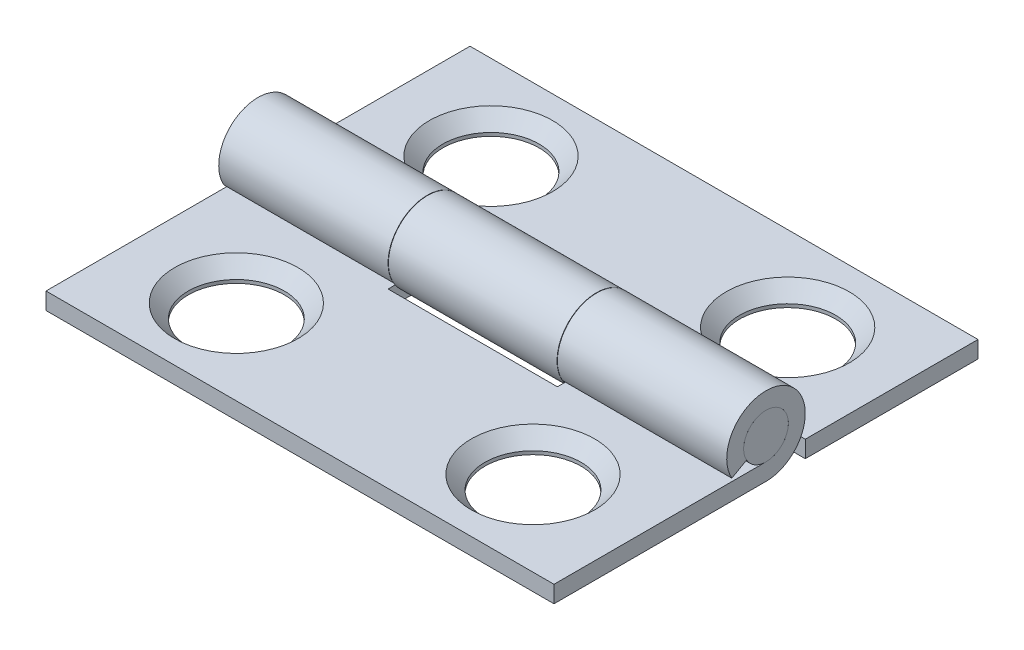
ISO-10303-21;
HEADER;
FILE_DESCRIPTION(('STEP AP214'),'2;1');
FILE_NAME('part.step','',(''),(''),'','','');
FILE_SCHEMA(('AUTOMOTIVE_DESIGN { 1 0 10303 214 1 1 1 1 }'));
ENDSEC;
DATA;
#1=APPLICATION_CONTEXT('core data for automotive mechanical design processes');
#2=APPLICATION_PROTOCOL_DEFINITION('international standard','automotive_design',2000,#1);
#3=PRODUCT_CONTEXT('',#1,'mechanical');
#4=PRODUCT('Part','Part','',(#3));
#5=PRODUCT_RELATED_PRODUCT_CATEGORY('part','',(#4));
#6=PRODUCT_DEFINITION_FORMATION('','',#4);
#7=PRODUCT_DEFINITION_CONTEXT('part definition',#1,'design');
#8=PRODUCT_DEFINITION('design','',#6,#7);
#9=PRODUCT_DEFINITION_SHAPE('','',#8);
#10=(LENGTH_UNIT() NAMED_UNIT(*) SI_UNIT(.MILLI.,.METRE.));
#11=(NAMED_UNIT(*) PLANE_ANGLE_UNIT() SI_UNIT($,.RADIAN.));
#12=(NAMED_UNIT(*) SI_UNIT($,.STERADIAN.) SOLID_ANGLE_UNIT());
#13=UNCERTAINTY_MEASURE_WITH_UNIT(LENGTH_MEASURE(1.E-05),#10,'distance_accuracy_value','');
#14=(GEOMETRIC_REPRESENTATION_CONTEXT(3) GLOBAL_UNCERTAINTY_ASSIGNED_CONTEXT((#13)) GLOBAL_UNIT_ASSIGNED_CONTEXT((#10,
#11,#12)) REPRESENTATION_CONTEXT('',''));
#15=CARTESIAN_POINT('',(0.,0.,0.));
#16=DIRECTION('',(0.,0.,1.));
#17=DIRECTION('',(1.,0.,0.));
#18=AXIS2_PLACEMENT_3D('',#15,#16,#17);
#19=CARTESIAN_POINT('',(9.525,0.,0.));
#20=DIRECTION('',(-1.,0.,0.));
#21=DIRECTION('',(0.,0.,1.));
#22=AXIS2_PLACEMENT_3D('',#19,#20,#21);
#23=CYLINDRICAL_SURFACE('',#22,0.8382);
#24=CARTESIAN_POINT('',(9.525,0.,0.));
#25=DIRECTION('',(1.,0.,0.));
#26=DIRECTION('',(0.,0.,-1.));
#27=AXIS2_PLACEMENT_3D('',#24,#25,#26);
#28=CIRCLE('',#27,0.8382);
#29=CARTESIAN_POINT('',(9.525,0.,-0.8382));
#30=VERTEX_POINT('',#29);
#31=EDGE_CURVE('E12',#30,#30,#28,.T.);
#32=ORIENTED_EDGE('',*,*,#31,.F.);
#33=EDGE_LOOP('',(#32));
#34=FACE_BOUND('',#33,.T.);
#35=CARTESIAN_POINT('',(-9.525,0.,0.));
#36=DIRECTION('',(1.,0.,0.));
#37=DIRECTION('',(0.,0.,-1.));
#38=AXIS2_PLACEMENT_3D('',#35,#36,#37);
#39=CIRCLE('',#38,0.8382);
#40=CARTESIAN_POINT('',(-9.525,0.,-0.8382));
#41=VERTEX_POINT('',#40);
#42=EDGE_CURVE('E92',#41,#41,#39,.T.);
#43=ORIENTED_EDGE('',*,*,#42,.T.);
#44=EDGE_LOOP('',(#43));
#45=FACE_BOUND('',#44,.T.);
#46=ADVANCED_FACE('F89',(#34,#45),#23,.T.);
#47=CARTESIAN_POINT('',(9.525,0.,0.));
#48=DIRECTION('',(1.,0.,0.));
#49=DIRECTION('',(0.,0.,-1.));
#50=AXIS2_PLACEMENT_3D('',#47,#48,#49);
#51=PLANE('',#50);
#52=ORIENTED_EDGE('',*,*,#31,.T.);
#53=EDGE_LOOP('',(#52));
#54=FACE_BOUND('',#53,.T.);
#55=ADVANCED_FACE('F104',(#54),#51,.T.);
#56=CARTESIAN_POINT('',(-9.525,0.,0.));
#57=DIRECTION('',(1.,0.,0.));
#58=DIRECTION('',(0.,0.,-1.));
#59=AXIS2_PLACEMENT_3D('',#56,#57,#58);
#60=PLANE('',#59);
#61=ORIENTED_EDGE('',*,*,#42,.F.);
#62=EDGE_LOOP('',(#61));
#63=FACE_BOUND('',#62,.T.);
#64=ADVANCED_FACE('F102',(#63),#60,.F.);
#65=CLOSED_SHELL('',(#46,#55,#64));
#66=MANIFOLD_SOLID_BREP('B2',#65);
#67=CARTESIAN_POINT('',(-9.525,0.,0.));
#68=DIRECTION('',(1.,0.,0.));
#69=DIRECTION('',(0.,0.,-1.));
#70=AXIS2_PLACEMENT_3D('',#67,#68,#69);
#71=CYLINDRICAL_SURFACE('',#70,1.47320000000008);
#72=DIRECTION('',(1.,0.,0.));
#73=VECTOR('',#72,1.);
#74=CARTESIAN_POINT('',(-9.525,-0.728533124002552,-1.28045215733782));
#75=LINE('',#74,#73);
#76=CARTESIAN_POINT('',(-3.1623,-0.728533124002552,-1.28045215733782));
#77=VERTEX_POINT('',#76);
#78=CARTESIAN_POINT('',(3.16230000000002,-0.728533124002552,-1.28045215733782));
#79=VERTEX_POINT('',#78);
#80=EDGE_CURVE('E287',#77,#79,#75,.T.);
#81=ORIENTED_EDGE('',*,*,#80,.F.);
#82=CARTESIAN_POINT('',(-3.1623,0.,0.));
#83=DIRECTION('',(1.,0.,0.));
#84=DIRECTION('',(0.,0.,-1.));
#85=AXIS2_PLACEMENT_3D('',#82,#83,#84);
#86=CIRCLE('',#85,1.47320000000008);
#87=CARTESIAN_POINT('',(-3.1623,-1.4732,0.));
#88=VERTEX_POINT('',#87);
#89=EDGE_CURVE('E266',#77,#88,#86,.T.);
#90=ORIENTED_EDGE('',*,*,#89,.T.);
#91=DIRECTION('',(1.,0.,0.));
#92=VECTOR('',#91,1.);
#93=CARTESIAN_POINT('',(-9.525,-1.4732,0.));
#94=LINE('',#93,#92);
#95=CARTESIAN_POINT('',(3.16230000000001,-1.4732,0.));
#96=VERTEX_POINT('',#95);
#97=EDGE_CURVE('E237',#88,#96,#94,.T.);
#98=ORIENTED_EDGE('',*,*,#97,.T.);
#99=CARTESIAN_POINT('',(3.16230000000002,0.,0.));
#100=DIRECTION('',(-1.,0.,0.));
#101=DIRECTION('',(0.,0.,1.));
#102=AXIS2_PLACEMENT_3D('',#99,#100,#101);
#103=CIRCLE('',#102,1.47320000000008);
#104=EDGE_CURVE('E258',#96,#79,#103,.T.);
#105=ORIENTED_EDGE('',*,*,#104,.T.);
#106=EDGE_LOOP('',(#81,#90,#98,#105));
#107=FACE_BOUND('',#106,.T.);
#108=ADVANCED_FACE('F138',(#107),#71,.T.);
#109=CARTESIAN_POINT('',(-9.525,0.,0.));
#110=DIRECTION('',(1.,0.,0.));
#111=DIRECTION('',(0.,0.,-1.));
#112=AXIS2_PLACEMENT_3D('',#109,#110,#111);
#113=CYLINDRICAL_SURFACE('',#112,0.8382);
#114=DIRECTION('',(1.,0.,0.));
#115=VECTOR('',#114,1.);
#116=CARTESIAN_POINT('',(-9.525,-0.8382,0.));
#117=LINE('',#116,#115);
#118=CARTESIAN_POINT('',(-3.1623,-0.8382,0.));
#119=VERTEX_POINT('',#118);
#120=CARTESIAN_POINT('',(3.16230000000002,-0.8382,0.));
#121=VERTEX_POINT('',#120);
#122=EDGE_CURVE('E297',#119,#121,#117,.T.);
#123=ORIENTED_EDGE('',*,*,#122,.F.);
#124=CARTESIAN_POINT('',(-3.1623,0.,0.));
#125=DIRECTION('',(1.,0.,0.));
#126=DIRECTION('',(0.,0.,-1.));
#127=AXIS2_PLACEMENT_3D('',#124,#125,#126);
#128=CIRCLE('',#127,0.8382);
#129=CARTESIAN_POINT('',(-3.1623,-0.41451022572559,-0.728533124002553));
#130=VERTEX_POINT('',#129);
#131=EDGE_CURVE('E265',#119,#130,#128,.F.);
#132=ORIENTED_EDGE('',*,*,#131,.T.);
#133=DIRECTION('',(1.,0.,0.));
#134=VECTOR('',#133,1.);
#135=CARTESIAN_POINT('',(-9.525,-0.41451022572559,-0.728533124002553));
#136=LINE('',#135,#134);
#137=CARTESIAN_POINT('',(3.16230000000002,-0.41451022572559,-0.728533124002553));
#138=VERTEX_POINT('',#137);
#139=EDGE_CURVE('E279',#130,#138,#136,.T.);
#140=ORIENTED_EDGE('',*,*,#139,.T.);
#141=CARTESIAN_POINT('',(3.16230000000002,0.,0.));
#142=DIRECTION('',(-1.,0.,0.));
#143=DIRECTION('',(0.,0.,1.));
#144=AXIS2_PLACEMENT_3D('',#141,#142,#143);
#145=CIRCLE('',#144,0.8382);
#146=EDGE_CURVE('E257',#138,#121,#145,.F.);
#147=ORIENTED_EDGE('',*,*,#146,.T.);
#148=EDGE_LOOP('',(#123,#132,#140,#147));
#149=FACE_BOUND('',#148,.T.);
#150=ADVANCED_FACE('F140',(#149),#113,.F.);
#151=CARTESIAN_POINT('',(-9.525,-0.838199999999995,-7.9502));
#152=DIRECTION('',(0.,-1.,0.));
#153=DIRECTION('',(0.,0.,1.));
#154=AXIS2_PLACEMENT_3D('',#151,#152,#153);
#155=PLANE('',#154);
#156=CARTESIAN_POINT('',(5.5626,-0.838199999999997,-4.7752));
#157=DIRECTION('',(0.,1.,0.));
#158=DIRECTION('',(0.,0.,1.));
#159=AXIS2_PLACEMENT_3D('',#156,#157,#158);
#160=CIRCLE('',#159,2.3114);
#161=CARTESIAN_POINT('',(5.5626,-0.838199999999998,-2.4638));
#162=VERTEX_POINT('',#161);
#163=EDGE_CURVE('E251',#162,#162,#160,.T.);
#164=ORIENTED_EDGE('',*,*,#163,.F.);
#165=EDGE_LOOP('',(#164));
#166=FACE_BOUND('',#165,.T.);
#167=CARTESIAN_POINT('',(-5.5626,-0.838199999999997,-4.7752));
#168=DIRECTION('',(0.,1.,0.));
#169=DIRECTION('',(0.,0.,1.));
#170=AXIS2_PLACEMENT_3D('',#167,#168,#169);
#171=CIRCLE('',#170,2.3114);
#172=CARTESIAN_POINT('',(-5.5626,-0.838199999999998,-2.4638));
#173=VERTEX_POINT('',#172);
#174=EDGE_CURVE('E244',#173,#173,#171,.T.);
#175=ORIENTED_EDGE('',*,*,#174,.F.);
#176=EDGE_LOOP('',(#175));
#177=FACE_BOUND('',#176,.T.);
#178=DIRECTION('',(1.,0.,0.));
#179=VECTOR('',#178,1.);
#180=CARTESIAN_POINT('',(-9.525,-0.838199999999999,-1.47320000000003));
#181=LINE('',#180,#179);
#182=CARTESIAN_POINT('',(-9.525,-0.838199999999999,-1.47320000000003));
#183=VERTEX_POINT('',#182);
#184=CARTESIAN_POINT('',(-3.1623,-0.838199999999999,-1.47320000000003));
#185=VERTEX_POINT('',#184);
#186=EDGE_CURVE('E155',#183,#185,#181,.T.);
#187=ORIENTED_EDGE('',*,*,#186,.T.);
#188=DIRECTION('',(0.,0.,1.));
#189=VECTOR('',#188,1.);
#190=CARTESIAN_POINT('',(-3.1623,-0.838199999999995,-7.9502));
#191=LINE('',#190,#189);
#192=EDGE_CURVE('E224',#185,#119,#191,.T.);
#193=ORIENTED_EDGE('',*,*,#192,.T.);
#194=ORIENTED_EDGE('',*,*,#122,.T.);
#195=DIRECTION('',(0.,0.,-1.));
#196=VECTOR('',#195,1.);
#197=CARTESIAN_POINT('',(3.16230000000002,-0.838199999999995,-7.9502));
#198=LINE('',#197,#196);
#199=CARTESIAN_POINT('',(3.16230000000001,-0.838199999999999,-1.47320000000003));
#200=VERTEX_POINT('',#199);
#201=EDGE_CURVE('E260',#121,#200,#198,.T.);
#202=ORIENTED_EDGE('',*,*,#201,.T.);
#203=DIRECTION('',(1.,0.,0.));
#204=VECTOR('',#203,1.);
#205=CARTESIAN_POINT('',(-9.525,-0.838199999999999,-1.47320000000003));
#206=LINE('',#205,#204);
#207=CARTESIAN_POINT('',(9.525,-0.838199999999998,-1.47320000000003));
#208=VERTEX_POINT('',#207);
#209=EDGE_CURVE('E247',#200,#208,#206,.T.);
#210=ORIENTED_EDGE('',*,*,#209,.T.);
#211=DIRECTION('',(0.,0.,-1.));
#212=VECTOR('',#211,1.);
#213=CARTESIAN_POINT('',(9.525,-0.838199999999995,-7.9502));
#214=LINE('',#213,#212);
#215=CARTESIAN_POINT('',(9.525,-0.838199999999995,-7.9502));
#216=VERTEX_POINT('',#215);
#217=EDGE_CURVE('E271',#208,#216,#214,.T.);
#218=ORIENTED_EDGE('',*,*,#217,.T.);
#219=DIRECTION('',(1.,0.,0.));
#220=VECTOR('',#219,1.);
#221=CARTESIAN_POINT('',(-9.525,-0.838199999999995,-7.9502));
#222=LINE('',#221,#220);
#223=CARTESIAN_POINT('',(-9.525,-0.838199999999995,-7.9502));
#224=VERTEX_POINT('',#223);
#225=EDGE_CURVE('E294',#224,#216,#222,.T.);
#226=ORIENTED_EDGE('',*,*,#225,.F.);
#227=DIRECTION('',(0.,0.,-1.));
#228=VECTOR('',#227,1.);
#229=CARTESIAN_POINT('',(-9.525,-0.838199999999995,-7.9502));
#230=LINE('',#229,#228);
#231=EDGE_CURVE('E272',#183,#224,#230,.T.);
#232=ORIENTED_EDGE('',*,*,#231,.F.);
#233=EDGE_LOOP('',(#187,#193,#194,#202,#210,#218,#226,#232));
#234=FACE_BOUND('',#233,.T.);
#235=ADVANCED_FACE('F322',(#166,#177,#234),#155,.F.);
#236=CARTESIAN_POINT('',(-9.525,-1.4732,-7.9502));
#237=DIRECTION('',(0.,0.,1.));
#238=DIRECTION('',(1.,0.,0.));
#239=AXIS2_PLACEMENT_3D('',#236,#237,#238);
#240=PLANE('',#239);
#241=DIRECTION('',(0.,-1.,0.));
#242=VECTOR('',#241,1.);
#243=CARTESIAN_POINT('',(9.525,-1.4732,-7.9502));
#244=LINE('',#243,#242);
#245=CARTESIAN_POINT('',(9.525,-1.4732,-7.9502));
#246=VERTEX_POINT('',#245);
#247=EDGE_CURVE('E281',#216,#246,#244,.T.);
#248=ORIENTED_EDGE('',*,*,#247,.T.);
#249=DIRECTION('',(1.,0.,0.));
#250=VECTOR('',#249,1.);
#251=CARTESIAN_POINT('',(-9.525,-1.4732,-7.9502));
#252=LINE('',#251,#250);
#253=CARTESIAN_POINT('',(-9.525,-1.4732,-7.9502));
#254=VERTEX_POINT('',#253);
#255=EDGE_CURVE('E291',#254,#246,#252,.T.);
#256=ORIENTED_EDGE('',*,*,#255,.F.);
#257=DIRECTION('',(0.,-1.,0.));
#258=VECTOR('',#257,1.);
#259=CARTESIAN_POINT('',(-9.525,-1.4732,-7.9502));
#260=LINE('',#259,#258);
#261=EDGE_CURVE('E274',#224,#254,#260,.T.);
#262=ORIENTED_EDGE('',*,*,#261,.F.);
#263=ORIENTED_EDGE('',*,*,#225,.T.);
#264=EDGE_LOOP('',(#248,#256,#262,#263));
#265=FACE_BOUND('',#264,.T.);
#266=ADVANCED_FACE('F325',(#265),#240,.F.);
#267=CARTESIAN_POINT('',(-9.525,-1.4732,0.));
#268=DIRECTION('',(0.,1.,0.));
#269=DIRECTION('',(0.,0.,-1.));
#270=AXIS2_PLACEMENT_3D('',#267,#268,#269);
#271=PLANE('',#270);
#272=CARTESIAN_POINT('',(-5.5626,-1.47320000000001,-4.7752));
#273=DIRECTION('',(0.,1.,0.));
#274=DIRECTION('',(0.,0.,1.));
#275=AXIS2_PLACEMENT_3D('',#272,#273,#274);
#276=CIRCLE('',#275,1.8034);
#277=CARTESIAN_POINT('',(-5.5626,-1.47320000000001,-2.9718));
#278=VERTEX_POINT('',#277);
#279=EDGE_CURVE('E303',#278,#278,#276,.T.);
#280=ORIENTED_EDGE('',*,*,#279,.T.);
#281=EDGE_LOOP('',(#280));
#282=FACE_BOUND('',#281,.T.);
#283=CARTESIAN_POINT('',(5.5626,-1.47320000000001,-4.7752));
#284=DIRECTION('',(0.,1.,0.));
#285=DIRECTION('',(0.,0.,1.));
#286=AXIS2_PLACEMENT_3D('',#283,#284,#285);
#287=CIRCLE('',#286,1.8034);
#288=CARTESIAN_POINT('',(5.5626,-1.47320000000001,-2.9718));
#289=VERTEX_POINT('',#288);
#290=EDGE_CURVE('E308',#289,#289,#287,.T.);
#291=ORIENTED_EDGE('',*,*,#290,.T.);
#292=EDGE_LOOP('',(#291));
#293=FACE_BOUND('',#292,.T.);
#294=ORIENTED_EDGE('',*,*,#97,.F.);
#295=DIRECTION('',(0.,0.,-1.));
#296=VECTOR('',#295,1.);
#297=CARTESIAN_POINT('',(-3.1623,-1.4732,-1.47320000000003));
#298=LINE('',#297,#296);
#299=CARTESIAN_POINT('',(-3.1623,-1.4732,-1.47320000000003));
#300=VERTEX_POINT('',#299);
#301=EDGE_CURVE('E221',#88,#300,#298,.T.);
#302=ORIENTED_EDGE('',*,*,#301,.T.);
#303=DIRECTION('',(-1.,0.,0.));
#304=VECTOR('',#303,1.);
#305=CARTESIAN_POINT('',(-3.1623,-1.4732,-1.47320000000003));
#306=LINE('',#305,#304);
#307=CARTESIAN_POINT('',(-9.52499999999999,-1.4732,-1.47320000000003));
#308=VERTEX_POINT('',#307);
#309=EDGE_CURVE('E226',#300,#308,#306,.T.);
#310=ORIENTED_EDGE('',*,*,#309,.T.);
#311=DIRECTION('',(0.,0.,1.));
#312=VECTOR('',#311,1.);
#313=CARTESIAN_POINT('',(-9.525,-1.4732,0.));
#314=LINE('',#313,#312);
#315=EDGE_CURVE('E277',#254,#308,#314,.T.);
#316=ORIENTED_EDGE('',*,*,#315,.F.);
#317=ORIENTED_EDGE('',*,*,#255,.T.);
#318=DIRECTION('',(0.,0.,1.));
#319=VECTOR('',#318,1.);
#320=CARTESIAN_POINT('',(9.525,-1.4732,0.));
#321=LINE('',#320,#319);
#322=CARTESIAN_POINT('',(9.525,-1.4732,-1.47320000000003));
#323=VERTEX_POINT('',#322);
#324=EDGE_CURVE('E275',#246,#323,#321,.T.);
#325=ORIENTED_EDGE('',*,*,#324,.T.);
#326=DIRECTION('',(-1.,0.,0.));
#327=VECTOR('',#326,1.);
#328=CARTESIAN_POINT('',(3.16230000000001,-1.4732,-1.47320000000003));
#329=LINE('',#328,#327);
#330=CARTESIAN_POINT('',(3.16230000000001,-1.4732,-1.47320000000003));
#331=VERTEX_POINT('',#330);
#332=EDGE_CURVE('E163',#323,#331,#329,.T.);
#333=ORIENTED_EDGE('',*,*,#332,.T.);
#334=DIRECTION('',(0.,0.,1.));
#335=VECTOR('',#334,1.);
#336=CARTESIAN_POINT('',(3.16230000000001,-1.4732,-1.47320000000003));
#337=LINE('',#336,#335);
#338=EDGE_CURVE('E249',#331,#96,#337,.T.);
#339=ORIENTED_EDGE('',*,*,#338,.T.);
#340=EDGE_LOOP('',(#294,#302,#310,#316,#317,#325,#333,#339));
#341=FACE_BOUND('',#340,.T.);
#342=ADVANCED_FACE('F234',(#282,#293,#341),#271,.F.);
#343=CARTESIAN_POINT('',(-9.525,-0.41451022572559,-0.728533124002553));
#344=DIRECTION('',(0.,0.869163832024043,-0.49452424925506));
#345=DIRECTION('',(0.,-0.49452424925506,-0.869163832024044));
#346=AXIS2_PLACEMENT_3D('',#343,#344,#345);
#347=PLANE('',#346);
#348=ORIENTED_EDGE('',*,*,#139,.F.);
#349=DIRECTION('',(0.,-0.49452424925506,-0.869163832024044));
#350=VECTOR('',#349,1.);
#351=CARTESIAN_POINT('',(-3.1623,-0.414510225725591,-0.728533124002554));
#352=LINE('',#351,#350);
#353=EDGE_CURVE('E87',#130,#77,#352,.T.);
#354=ORIENTED_EDGE('',*,*,#353,.T.);
#355=ORIENTED_EDGE('',*,*,#80,.T.);
#356=DIRECTION('',(0.,0.49452424925506,0.869163832024044));
#357=VECTOR('',#356,1.);
#358=CARTESIAN_POINT('',(3.16230000000002,-0.41451022572559,-0.728533124002553));
#359=LINE('',#358,#357);
#360=EDGE_CURVE('E147',#79,#138,#359,.T.);
#361=ORIENTED_EDGE('',*,*,#360,.T.);
#362=EDGE_LOOP('',(#348,#354,#355,#361));
#363=FACE_BOUND('',#362,.T.);
#364=ADVANCED_FACE('F348',(#363),#347,.F.);
#365=CARTESIAN_POINT('',(-9.525,0.,0.));
#366=DIRECTION('',(1.,0.,0.));
#367=DIRECTION('',(0.,0.,-1.));
#368=AXIS2_PLACEMENT_3D('',#365,#366,#367);
#369=PLANE('',#368);
#370=ORIENTED_EDGE('',*,*,#315,.T.);
#371=DIRECTION('',(0.,1.,0.));
#372=VECTOR('',#371,1.);
#373=CARTESIAN_POINT('',(-9.52499999999999,-1.4732,-1.47320000000003));
#374=LINE('',#373,#372);
#375=EDGE_CURVE('E225',#308,#183,#374,.T.);
#376=ORIENTED_EDGE('',*,*,#375,.T.);
#377=ORIENTED_EDGE('',*,*,#231,.T.);
#378=ORIENTED_EDGE('',*,*,#261,.T.);
#379=EDGE_LOOP('',(#370,#376,#377,#378));
#380=FACE_BOUND('',#379,.T.);
#381=ADVANCED_FACE('F332',(#380),#369,.F.);
#382=CARTESIAN_POINT('',(9.525,0.,0.));
#383=DIRECTION('',(1.,0.,0.));
#384=DIRECTION('',(0.,0.,-1.));
#385=AXIS2_PLACEMENT_3D('',#382,#383,#384);
#386=PLANE('',#385);
#387=DIRECTION('',(0.,1.,0.));
#388=VECTOR('',#387,1.);
#389=CARTESIAN_POINT('',(9.525,-1.4732,-1.47320000000003));
#390=LINE('',#389,#388);
#391=EDGE_CURVE('E241',#323,#208,#390,.T.);
#392=ORIENTED_EDGE('',*,*,#391,.F.);
#393=ORIENTED_EDGE('',*,*,#324,.F.);
#394=ORIENTED_EDGE('',*,*,#247,.F.);
#395=ORIENTED_EDGE('',*,*,#217,.F.);
#396=EDGE_LOOP('',(#392,#393,#394,#395));
#397=FACE_BOUND('',#396,.T.);
#398=ADVANCED_FACE('F338',(#397),#386,.T.);
#399=CARTESIAN_POINT('',(3.16230000000001,-1.4732,-1.47320000000003));
#400=DIRECTION('',(-1.,0.,0.));
#401=DIRECTION('',(0.,0.,1.));
#402=AXIS2_PLACEMENT_3D('',#399,#400,#401);
#403=PLANE('',#402);
#404=ORIENTED_EDGE('',*,*,#146,.F.);
#405=ORIENTED_EDGE('',*,*,#360,.F.);
#406=ORIENTED_EDGE('',*,*,#104,.F.);
#407=ORIENTED_EDGE('',*,*,#338,.F.);
#408=DIRECTION('',(0.,1.,0.));
#409=VECTOR('',#408,1.);
#410=CARTESIAN_POINT('',(3.16230000000001,-1.4732,-1.47320000000003));
#411=LINE('',#410,#409);
#412=EDGE_CURVE('E238',#331,#200,#411,.T.);
#413=ORIENTED_EDGE('',*,*,#412,.T.);
#414=ORIENTED_EDGE('',*,*,#201,.F.);
#415=EDGE_LOOP('',(#404,#405,#406,#407,#413,#414));
#416=FACE_BOUND('',#415,.T.);
#417=ADVANCED_FACE('F342',(#416),#403,.F.);
#418=CARTESIAN_POINT('',(3.16230000000001,-1.4732,-1.47320000000003));
#419=DIRECTION('',(0.,0.,-1.));
#420=DIRECTION('',(-1.,0.,0.));
#421=AXIS2_PLACEMENT_3D('',#418,#419,#420);
#422=PLANE('',#421);
#423=ORIENTED_EDGE('',*,*,#412,.F.);
#424=ORIENTED_EDGE('',*,*,#332,.F.);
#425=ORIENTED_EDGE('',*,*,#391,.T.);
#426=ORIENTED_EDGE('',*,*,#209,.F.);
#427=EDGE_LOOP('',(#423,#424,#425,#426));
#428=FACE_BOUND('',#427,.T.);
#429=ADVANCED_FACE('F340',(#428),#422,.F.);
#430=CARTESIAN_POINT('',(-3.1623,-1.4732,-1.47320000000003));
#431=DIRECTION('',(1.,0.,0.));
#432=DIRECTION('',(0.,0.,-1.));
#433=AXIS2_PLACEMENT_3D('',#430,#431,#432);
#434=PLANE('',#433);
#435=ORIENTED_EDGE('',*,*,#89,.F.);
#436=ORIENTED_EDGE('',*,*,#353,.F.);
#437=ORIENTED_EDGE('',*,*,#131,.F.);
#438=ORIENTED_EDGE('',*,*,#192,.F.);
#439=DIRECTION('',(0.,1.,0.));
#440=VECTOR('',#439,1.);
#441=CARTESIAN_POINT('',(-3.1623,-1.4732,-1.47320000000003));
#442=LINE('',#441,#440);
#443=EDGE_CURVE('E217',#300,#185,#442,.T.);
#444=ORIENTED_EDGE('',*,*,#443,.F.);
#445=ORIENTED_EDGE('',*,*,#301,.F.);
#446=EDGE_LOOP('',(#435,#436,#437,#438,#444,#445));
#447=FACE_BOUND('',#446,.T.);
#448=ADVANCED_FACE('F219',(#447),#434,.F.);
#449=CARTESIAN_POINT('',(-3.1623,-1.4732,-1.47320000000003));
#450=DIRECTION('',(0.,0.,-1.));
#451=DIRECTION('',(-1.,0.,0.));
#452=AXIS2_PLACEMENT_3D('',#449,#450,#451);
#453=PLANE('',#452);
#454=ORIENTED_EDGE('',*,*,#375,.F.);
#455=ORIENTED_EDGE('',*,*,#309,.F.);
#456=ORIENTED_EDGE('',*,*,#443,.T.);
#457=ORIENTED_EDGE('',*,*,#186,.F.);
#458=EDGE_LOOP('',(#454,#455,#456,#457));
#459=FACE_BOUND('',#458,.T.);
#460=ADVANCED_FACE('F229',(#459),#453,.F.);
#461=CARTESIAN_POINT('',(-5.5626,-0.838199999999997,-4.7752));
#462=DIRECTION('',(0.,1.,0.));
#463=DIRECTION('',(0.,0.,1.));
#464=AXIS2_PLACEMENT_3D('',#461,#462,#463);
#465=CONICAL_SURFACE('',#464,2.3114,0.78539816339745);
#466=CARTESIAN_POINT('',(-5.5626,-1.3462,-4.7752));
#467=DIRECTION('',(0.,1.,0.));
#468=DIRECTION('',(0.,0.,1.));
#469=AXIS2_PLACEMENT_3D('',#466,#467,#468);
#470=CIRCLE('',#469,1.8034);
#471=CARTESIAN_POINT('',(-5.5626,-1.3462,-2.9718));
#472=VERTEX_POINT('',#471);
#473=EDGE_CURVE('E142',#472,#472,#470,.F.);
#474=ORIENTED_EDGE('',*,*,#473,.T.);
#475=EDGE_LOOP('',(#474));
#476=FACE_BOUND('',#475,.T.);
#477=ORIENTED_EDGE('',*,*,#174,.T.);
#478=EDGE_LOOP('',(#477));
#479=FACE_BOUND('',#478,.T.);
#480=ADVANCED_FACE('F320',(#476,#479),#465,.F.);
#481=CARTESIAN_POINT('',(5.5626,-0.838199999999997,-4.7752));
#482=DIRECTION('',(0.,1.,0.));
#483=DIRECTION('',(0.,0.,1.));
#484=AXIS2_PLACEMENT_3D('',#481,#482,#483);
#485=CONICAL_SURFACE('',#484,2.3114,0.78539816339745);
#486=CARTESIAN_POINT('',(5.5626,-1.3462,-4.7752));
#487=DIRECTION('',(0.,1.,0.));
#488=DIRECTION('',(0.,0.,1.));
#489=AXIS2_PLACEMENT_3D('',#486,#487,#488);
#490=CIRCLE('',#489,1.8034);
#491=CARTESIAN_POINT('',(5.5626,-1.3462,-2.9718));
#492=VERTEX_POINT('',#491);
#493=EDGE_CURVE('E301',#492,#492,#490,.F.);
#494=ORIENTED_EDGE('',*,*,#493,.T.);
#495=EDGE_LOOP('',(#494));
#496=FACE_BOUND('',#495,.T.);
#497=ORIENTED_EDGE('',*,*,#163,.T.);
#498=EDGE_LOOP('',(#497));
#499=FACE_BOUND('',#498,.T.);
#500=ADVANCED_FACE('F417',(#496,#499),#485,.F.);
#501=CARTESIAN_POINT('',(5.5626,-1.47320000000001,-4.7752));
#502=DIRECTION('',(0.,1.,0.));
#503=DIRECTION('',(0.,0.,1.));
#504=AXIS2_PLACEMENT_3D('',#501,#502,#503);
#505=CYLINDRICAL_SURFACE('',#504,1.8034);
#506=ORIENTED_EDGE('',*,*,#290,.F.);
#507=EDGE_LOOP('',(#506));
#508=FACE_BOUND('',#507,.T.);
#509=ORIENTED_EDGE('',*,*,#493,.F.);
#510=EDGE_LOOP('',(#509));
#511=FACE_BOUND('',#510,.T.);
#512=ADVANCED_FACE('F425',(#508,#511),#505,.F.);
#513=CARTESIAN_POINT('',(-5.5626,-1.47320000000001,-4.7752));
#514=DIRECTION('',(0.,1.,0.));
#515=DIRECTION('',(0.,0.,1.));
#516=AXIS2_PLACEMENT_3D('',#513,#514,#515);
#517=CYLINDRICAL_SURFACE('',#516,1.8034);
#518=ORIENTED_EDGE('',*,*,#279,.F.);
#519=EDGE_LOOP('',(#518));
#520=FACE_BOUND('',#519,.T.);
#521=ORIENTED_EDGE('',*,*,#473,.F.);
#522=EDGE_LOOP('',(#521));
#523=FACE_BOUND('',#522,.T.);
#524=ADVANCED_FACE('F432',(#520,#523),#517,.F.);
#525=CLOSED_SHELL('',(#108,#150,#235,#266,#342,#364,#381,#398,#417,#429,#448,#460,#480,#500,
#512,#524));
#526=MANIFOLD_SOLID_BREP('B7',#525);
#527=CARTESIAN_POINT('',(9.525,0.,0.));
#528=DIRECTION('',(-1.,0.,0.));
#529=DIRECTION('',(0.,0.,1.));
#530=AXIS2_PLACEMENT_3D('',#527,#528,#529);
#531=CYLINDRICAL_SURFACE('',#530,0.8382);
#532=DIRECTION('',(-1.,0.,0.));
#533=VECTOR('',#532,1.);
#534=CARTESIAN_POINT('',(9.525,-0.414510225725591,0.728533124002553));
#535=LINE('',#534,#533);
#536=CARTESIAN_POINT('',(9.525,-0.414510225725591,0.728533124002553));
#537=VERTEX_POINT('',#536);
#538=CARTESIAN_POINT('',(3.175,-0.414510225725591,0.728533124002553));
#539=VERTEX_POINT('',#538);
#540=EDGE_CURVE('E609',#537,#539,#535,.T.);
#541=ORIENTED_EDGE('',*,*,#540,.T.);
#542=CARTESIAN_POINT('',(3.175,0.,0.));
#543=DIRECTION('',(1.,0.,0.));
#544=DIRECTION('',(0.,0.,-1.));
#545=AXIS2_PLACEMENT_3D('',#542,#543,#544);
#546=CIRCLE('',#545,0.8382);
#547=CARTESIAN_POINT('',(3.175,-0.8382,0.));
#548=VERTEX_POINT('',#547);
#549=EDGE_CURVE('E659',#539,#548,#546,.F.);
#550=ORIENTED_EDGE('',*,*,#549,.T.);
#551=DIRECTION('',(-1.,0.,0.));
#552=VECTOR('',#551,1.);
#553=CARTESIAN_POINT('',(9.525,-0.8382,0.));
#554=LINE('',#553,#552);
#555=CARTESIAN_POINT('',(9.525,-0.8382,0.));
#556=VERTEX_POINT('',#555);
#557=EDGE_CURVE('E619',#556,#548,#554,.T.);
#558=ORIENTED_EDGE('',*,*,#557,.F.);
#559=CARTESIAN_POINT('',(9.525,0.,0.));
#560=DIRECTION('',(-1.,0.,0.));
#561=DIRECTION('',(0.,0.,1.));
#562=AXIS2_PLACEMENT_3D('',#559,#560,#561);
#563=CIRCLE('',#562,0.8382);
#564=EDGE_CURVE('E608',#537,#556,#563,.T.);
#565=ORIENTED_EDGE('',*,*,#564,.F.);
#566=EDGE_LOOP('',(#541,#550,#558,#565));
#567=FACE_BOUND('',#566,.T.);
#568=ADVANCED_FACE('F489',(#567),#531,.F.);
#569=CARTESIAN_POINT('',(9.525,0.,0.));
#570=DIRECTION('',(-1.,0.,0.));
#571=DIRECTION('',(0.,0.,1.));
#572=AXIS2_PLACEMENT_3D('',#569,#570,#571);
#573=CYLINDRICAL_SURFACE('',#572,1.47320000000008);
#574=CARTESIAN_POINT('',(3.175,0.,0.));
#575=DIRECTION('',(1.,0.,0.));
#576=DIRECTION('',(0.,0.,-1.));
#577=AXIS2_PLACEMENT_3D('',#574,#575,#576);
#578=CIRCLE('',#577,1.47320000000008);
#579=CARTESIAN_POINT('',(3.175,-1.4732,0.));
#580=VERTEX_POINT('',#579);
#581=CARTESIAN_POINT('',(3.175,-0.728533124002552,1.28045215733782));
#582=VERTEX_POINT('',#581);
#583=EDGE_CURVE('E660',#580,#582,#578,.T.);
#584=ORIENTED_EDGE('',*,*,#583,.T.);
#585=DIRECTION('',(-1.,0.,0.));
#586=VECTOR('',#585,1.);
#587=CARTESIAN_POINT('',(9.525,-0.728533124002553,1.28045215733782));
#588=LINE('',#587,#586);
#589=CARTESIAN_POINT('',(9.525,-0.728533124002553,1.28045215733782));
#590=VERTEX_POINT('',#589);
#591=EDGE_CURVE('E588',#590,#582,#588,.T.);
#592=ORIENTED_EDGE('',*,*,#591,.F.);
#593=CARTESIAN_POINT('',(9.525,0.,0.));
#594=DIRECTION('',(1.,0.,0.));
#595=DIRECTION('',(0.,0.,1.));
#596=AXIS2_PLACEMENT_3D('',#593,#594,#595);
#597=CIRCLE('',#596,1.47320000000008);
#598=CARTESIAN_POINT('',(9.525,-1.4732,0.));
#599=VERTEX_POINT('',#598);
#600=EDGE_CURVE('E565',#599,#590,#597,.T.);
#601=ORIENTED_EDGE('',*,*,#600,.F.);
#602=DIRECTION('',(-1.,0.,0.));
#603=VECTOR('',#602,1.);
#604=CARTESIAN_POINT('',(9.525,-1.4732,0.));
#605=LINE('',#604,#603);
#606=EDGE_CURVE('E575',#599,#580,#605,.T.);
#607=ORIENTED_EDGE('',*,*,#606,.T.);
#608=EDGE_LOOP('',(#584,#592,#601,#607));
#609=FACE_BOUND('',#608,.T.);
#610=ADVANCED_FACE('F586',(#609),#573,.T.);
#611=CARTESIAN_POINT('',(9.525,-0.414510225725591,0.728533124002553));
#612=DIRECTION('',(0.,0.869163832024043,0.49452424925506));
#613=DIRECTION('',(0.,-0.49452424925506,0.869163832024043));
#614=AXIS2_PLACEMENT_3D('',#611,#612,#613);
#615=PLANE('',#614);
#616=ORIENTED_EDGE('',*,*,#591,.T.);
#617=DIRECTION('',(0.,0.49452424925506,-0.869163832024043));
#618=VECTOR('',#617,1.);
#619=CARTESIAN_POINT('',(3.175,-0.414510225725591,0.728533124002554));
#620=LINE('',#619,#618);
#621=EDGE_CURVE('E136',#582,#539,#620,.T.);
#622=ORIENTED_EDGE('',*,*,#621,.T.);
#623=ORIENTED_EDGE('',*,*,#540,.F.);
#624=DIRECTION('',(0.,0.49452424925506,-0.869163832024043));
#625=VECTOR('',#624,1.);
#626=CARTESIAN_POINT('',(9.525,-0.414510225725591,0.728533124002553));
#627=LINE('',#626,#625);
#628=EDGE_CURVE('E515',#590,#537,#627,.T.);
#629=ORIENTED_EDGE('',*,*,#628,.F.);
#630=EDGE_LOOP('',(#616,#622,#623,#629));
#631=FACE_BOUND('',#630,.T.);
#632=ADVANCED_FACE('F716',(#631),#615,.F.);
#633=CARTESIAN_POINT('',(-3.175,-0.8382,0.));
#634=VERTEX_POINT('',#633);
#635=CARTESIAN_POINT('',(-9.525,-0.8382,0.));
#636=VERTEX_POINT('',#635);
#637=EDGE_CURVE('E618',#634,#636,#554,.T.);
#638=ORIENTED_EDGE('',*,*,#637,.F.);
#639=CARTESIAN_POINT('',(-3.175,0.,0.));
#640=DIRECTION('',(-1.,0.,0.));
#641=DIRECTION('',(0.,0.,1.));
#642=AXIS2_PLACEMENT_3D('',#639,#640,#641);
#643=CIRCLE('',#642,0.8382);
#644=CARTESIAN_POINT('',(-3.175,-0.414510225725591,0.728533124002553));
#645=VERTEX_POINT('',#644);
#646=EDGE_CURVE('E651',#634,#645,#643,.F.);
#647=ORIENTED_EDGE('',*,*,#646,.T.);
#648=CARTESIAN_POINT('',(-9.525,-0.414510225725591,0.728533124002553));
#649=VERTEX_POINT('',#648);
#650=EDGE_CURVE('E543',#645,#649,#535,.T.);
#651=ORIENTED_EDGE('',*,*,#650,.T.);
#652=CARTESIAN_POINT('',(-9.525,0.,0.));
#653=DIRECTION('',(-1.,0.,0.));
#654=DIRECTION('',(0.,0.,1.));
#655=AXIS2_PLACEMENT_3D('',#652,#653,#654);
#656=CIRCLE('',#655,0.8382);
#657=EDGE_CURVE('E593',#649,#636,#656,.T.);
#658=ORIENTED_EDGE('',*,*,#657,.T.);
#659=EDGE_LOOP('',(#638,#647,#651,#658));
#660=FACE_BOUND('',#659,.T.);
#661=ADVANCED_FACE('F491',(#660),#531,.F.);
#662=CARTESIAN_POINT('',(9.525,-0.8382,7.9502));
#663=DIRECTION('',(0.,-1.,0.));
#664=DIRECTION('',(0.,0.,-1.));
#665=AXIS2_PLACEMENT_3D('',#662,#663,#664);
#666=PLANE('',#665);
#667=CARTESIAN_POINT('',(5.5626,-0.8382,4.7752));
#668=DIRECTION('',(0.,1.,0.));
#669=DIRECTION('',(0.,0.,1.));
#670=AXIS2_PLACEMENT_3D('',#667,#668,#669);
#671=CIRCLE('',#670,2.3114);
#672=CARTESIAN_POINT('',(5.5626,-0.8382,7.0866));
#673=VERTEX_POINT('',#672);
#674=EDGE_CURVE('E636',#673,#673,#671,.T.);
#675=ORIENTED_EDGE('',*,*,#674,.F.);
#676=EDGE_LOOP('',(#675));
#677=FACE_BOUND('',#676,.T.);
#678=CARTESIAN_POINT('',(-5.5626,-0.8382,4.7752));
#679=DIRECTION('',(0.,1.,0.));
#680=DIRECTION('',(0.,0.,1.));
#681=AXIS2_PLACEMENT_3D('',#678,#679,#680);
#682=CIRCLE('',#681,2.3114);
#683=CARTESIAN_POINT('',(-5.5626,-0.8382,7.0866));
#684=VERTEX_POINT('',#683);
#685=EDGE_CURVE('E627',#684,#684,#682,.T.);
#686=ORIENTED_EDGE('',*,*,#685,.F.);
#687=EDGE_LOOP('',(#686));
#688=FACE_BOUND('',#687,.T.);
#689=ORIENTED_EDGE('',*,*,#557,.T.);
#690=DIRECTION('',(0.,0.,1.));
#691=VECTOR('',#690,1.);
#692=CARTESIAN_POINT('',(3.175,-0.8382,7.9502));
#693=LINE('',#692,#691);
#694=CARTESIAN_POINT('',(3.175,-0.8382,1.47320000000012));
#695=VERTEX_POINT('',#694);
#696=EDGE_CURVE('E662',#548,#695,#693,.T.);
#697=ORIENTED_EDGE('',*,*,#696,.T.);
#698=DIRECTION('',(-1.,0.,0.));
#699=VECTOR('',#698,1.);
#700=CARTESIAN_POINT('',(9.525,-0.8382,1.47320000000012));
#701=LINE('',#700,#699);
#702=CARTESIAN_POINT('',(-3.175,-0.8382,1.47320000000012));
#703=VERTEX_POINT('',#702);
#704=EDGE_CURVE('E596',#695,#703,#701,.T.);
#705=ORIENTED_EDGE('',*,*,#704,.T.);
#706=DIRECTION('',(0.,0.,-1.));
#707=VECTOR('',#706,1.);
#708=CARTESIAN_POINT('',(-3.175,-0.8382,7.9502));
#709=LINE('',#708,#707);
#710=EDGE_CURVE('E655',#703,#634,#709,.T.);
#711=ORIENTED_EDGE('',*,*,#710,.T.);
#712=ORIENTED_EDGE('',*,*,#637,.T.);
#713=DIRECTION('',(0.,0.,1.));
#714=VECTOR('',#713,1.);
#715=CARTESIAN_POINT('',(-9.525,-0.8382,7.9502));
#716=LINE('',#715,#714);
#717=CARTESIAN_POINT('',(-9.525,-0.8382,7.9502));
#718=VERTEX_POINT('',#717);
#719=EDGE_CURVE('E595',#636,#718,#716,.T.);
#720=ORIENTED_EDGE('',*,*,#719,.T.);
#721=DIRECTION('',(-1.,0.,0.));
#722=VECTOR('',#721,1.);
#723=CARTESIAN_POINT('',(9.525,-0.8382,7.9502));
#724=LINE('',#723,#722);
#725=CARTESIAN_POINT('',(9.525,-0.8382,7.9502));
#726=VERTEX_POINT('',#725);
#727=EDGE_CURVE('E615',#726,#718,#724,.T.);
#728=ORIENTED_EDGE('',*,*,#727,.F.);
#729=DIRECTION('',(0.,0.,1.));
#730=VECTOR('',#729,1.);
#731=CARTESIAN_POINT('',(9.525,-0.8382,7.9502));
#732=LINE('',#731,#730);
#733=EDGE_CURVE('E552',#556,#726,#732,.T.);
#734=ORIENTED_EDGE('',*,*,#733,.F.);
#735=EDGE_LOOP('',(#689,#697,#705,#711,#712,#720,#728,#734));
#736=FACE_BOUND('',#735,.T.);
#737=ADVANCED_FACE('F672',(#677,#688,#736),#666,.F.);
#738=CARTESIAN_POINT('',(9.525,-1.4732,7.9502));
#739=DIRECTION('',(0.,0.,-1.));
#740=DIRECTION('',(-1.,0.,0.));
#741=AXIS2_PLACEMENT_3D('',#738,#739,#740);
#742=PLANE('',#741);
#743=DIRECTION('',(0.,-1.,0.));
#744=VECTOR('',#743,1.);
#745=CARTESIAN_POINT('',(-9.525,-1.4732,7.9502));
#746=LINE('',#745,#744);
#747=CARTESIAN_POINT('',(-9.525,-1.4732,7.9502));
#748=VERTEX_POINT('',#747);
#749=EDGE_CURVE('E598',#718,#748,#746,.T.);
#750=ORIENTED_EDGE('',*,*,#749,.T.);
#751=DIRECTION('',(-1.,0.,0.));
#752=VECTOR('',#751,1.);
#753=CARTESIAN_POINT('',(9.525,-1.4732,7.9502));
#754=LINE('',#753,#752);
#755=CARTESIAN_POINT('',(9.525,-1.4732,7.9502));
#756=VERTEX_POINT('',#755);
#757=EDGE_CURVE('E583',#756,#748,#754,.T.);
#758=ORIENTED_EDGE('',*,*,#757,.F.);
#759=DIRECTION('',(0.,-1.,0.));
#760=VECTOR('',#759,1.);
#761=CARTESIAN_POINT('',(9.525,-1.4732,7.9502));
#762=LINE('',#761,#760);
#763=EDGE_CURVE('E568',#726,#756,#762,.T.);
#764=ORIENTED_EDGE('',*,*,#763,.F.);
#765=ORIENTED_EDGE('',*,*,#727,.T.);
#766=EDGE_LOOP('',(#750,#758,#764,#765));
#767=FACE_BOUND('',#766,.T.);
#768=ADVANCED_FACE('F676',(#767),#742,.F.);
#769=CARTESIAN_POINT('',(9.525,-1.4732,0.));
#770=DIRECTION('',(0.,1.,0.));
#771=DIRECTION('',(0.,0.,1.));
#772=AXIS2_PLACEMENT_3D('',#769,#770,#771);
#773=PLANE('',#772);
#774=CARTESIAN_POINT('',(5.5626,-1.4732,4.7752));
#775=DIRECTION('',(0.,1.,0.));
#776=DIRECTION('',(0.,0.,1.));
#777=AXIS2_PLACEMENT_3D('',#774,#775,#776);
#778=CIRCLE('',#777,1.8034);
#779=CARTESIAN_POINT('',(5.5626,-1.4732,6.5786));
#780=VERTEX_POINT('',#779);
#781=EDGE_CURVE('E623',#780,#780,#778,.T.);
#782=ORIENTED_EDGE('',*,*,#781,.T.);
#783=EDGE_LOOP('',(#782));
#784=FACE_BOUND('',#783,.T.);
#785=CARTESIAN_POINT('',(-5.5626,-1.4732,4.7752));
#786=DIRECTION('',(0.,1.,0.));
#787=DIRECTION('',(0.,0.,1.));
#788=AXIS2_PLACEMENT_3D('',#785,#786,#787);
#789=CIRCLE('',#788,1.8034);
#790=CARTESIAN_POINT('',(-5.5626,-1.4732,6.5786));
#791=VERTEX_POINT('',#790);
#792=EDGE_CURVE('E629',#791,#791,#789,.T.);
#793=ORIENTED_EDGE('',*,*,#792,.T.);
#794=EDGE_LOOP('',(#793));
#795=FACE_BOUND('',#794,.T.);
#796=DIRECTION('',(1.,0.,0.));
#797=VECTOR('',#796,1.);
#798=CARTESIAN_POINT('',(3.175,-1.4732,1.47320000000012));
#799=LINE('',#798,#797);
#800=CARTESIAN_POINT('',(-3.175,-1.4732,1.47320000000012));
#801=VERTEX_POINT('',#800);
#802=CARTESIAN_POINT('',(3.175,-1.4732,1.47320000000012));
#803=VERTEX_POINT('',#802);
#804=EDGE_CURVE('E645',#801,#803,#799,.T.);
#805=ORIENTED_EDGE('',*,*,#804,.T.);
#806=DIRECTION('',(0.,0.,-1.));
#807=VECTOR('',#806,1.);
#808=CARTESIAN_POINT('',(3.175,-1.4732,-1.47320000000013));
#809=LINE('',#808,#807);
#810=EDGE_CURVE('E580',#803,#580,#809,.T.);
#811=ORIENTED_EDGE('',*,*,#810,.T.);
#812=ORIENTED_EDGE('',*,*,#606,.F.);
#813=DIRECTION('',(0.,0.,-1.));
#814=VECTOR('',#813,1.);
#815=CARTESIAN_POINT('',(9.525,-1.4732,0.));
#816=LINE('',#815,#814);
#817=EDGE_CURVE('E561',#756,#599,#816,.T.);
#818=ORIENTED_EDGE('',*,*,#817,.F.);
#819=ORIENTED_EDGE('',*,*,#757,.T.);
#820=DIRECTION('',(0.,0.,-1.));
#821=VECTOR('',#820,1.);
#822=CARTESIAN_POINT('',(-9.525,-1.4732,0.));
#823=LINE('',#822,#821);
#824=CARTESIAN_POINT('',(-9.525,-1.4732,0.));
#825=VERTEX_POINT('',#824);
#826=EDGE_CURVE('E600',#748,#825,#823,.T.);
#827=ORIENTED_EDGE('',*,*,#826,.T.);
#828=CARTESIAN_POINT('',(-3.175,-1.4732,0.));
#829=VERTEX_POINT('',#828);
#830=EDGE_CURVE('E584',#829,#825,#605,.T.);
#831=ORIENTED_EDGE('',*,*,#830,.F.);
#832=DIRECTION('',(0.,0.,1.));
#833=VECTOR('',#832,1.);
#834=CARTESIAN_POINT('',(-3.175,-1.4732,1.47320000000012));
#835=LINE('',#834,#833);
#836=EDGE_CURVE('E642',#829,#801,#835,.T.);
#837=ORIENTED_EDGE('',*,*,#836,.T.);
#838=EDGE_LOOP('',(#805,#811,#812,#818,#819,#827,#831,#837));
#839=FACE_BOUND('',#838,.T.);
#840=ADVANCED_FACE('F577',(#784,#795,#839),#773,.F.);
#841=CARTESIAN_POINT('',(-3.175,-0.728533124002553,1.28045215733782));
#842=VERTEX_POINT('',#841);
#843=CARTESIAN_POINT('',(-9.525,-0.728533124002553,1.28045215733782));
#844=VERTEX_POINT('',#843);
#845=EDGE_CURVE('E612',#842,#844,#588,.T.);
#846=ORIENTED_EDGE('',*,*,#845,.F.);
#847=CARTESIAN_POINT('',(-3.175,0.,0.));
#848=DIRECTION('',(-1.,0.,0.));
#849=DIRECTION('',(0.,0.,1.));
#850=AXIS2_PLACEMENT_3D('',#847,#848,#849);
#851=CIRCLE('',#850,1.47320000000008);
#852=EDGE_CURVE('E506',#842,#829,#851,.T.);
#853=ORIENTED_EDGE('',*,*,#852,.T.);
#854=ORIENTED_EDGE('',*,*,#830,.T.);
#855=CARTESIAN_POINT('',(-9.525,0.,0.));
#856=DIRECTION('',(1.,0.,0.));
#857=DIRECTION('',(0.,0.,1.));
#858=AXIS2_PLACEMENT_3D('',#855,#856,#857);
#859=CIRCLE('',#858,1.47320000000008);
#860=EDGE_CURVE('E603',#825,#844,#859,.T.);
#861=ORIENTED_EDGE('',*,*,#860,.T.);
#862=EDGE_LOOP('',(#846,#853,#854,#861));
#863=FACE_BOUND('',#862,.T.);
#864=ADVANCED_FACE('F686',(#863),#573,.T.);
#865=ORIENTED_EDGE('',*,*,#650,.F.);
#866=DIRECTION('',(0.,-0.49452424925506,0.869163832024043));
#867=VECTOR('',#866,1.);
#868=CARTESIAN_POINT('',(-3.175,-0.414510225725592,0.728533124002554));
#869=LINE('',#868,#867);
#870=EDGE_CURVE('E498',#645,#842,#869,.T.);
#871=ORIENTED_EDGE('',*,*,#870,.T.);
#872=ORIENTED_EDGE('',*,*,#845,.T.);
#873=DIRECTION('',(0.,0.49452424925506,-0.869163832024043));
#874=VECTOR('',#873,1.);
#875=CARTESIAN_POINT('',(-9.525,-0.414510225725591,0.728533124002553));
#876=LINE('',#875,#874);
#877=EDGE_CURVE('E606',#844,#649,#876,.T.);
#878=ORIENTED_EDGE('',*,*,#877,.T.);
#879=EDGE_LOOP('',(#865,#871,#872,#878));
#880=FACE_BOUND('',#879,.T.);
#881=ADVANCED_FACE('F725',(#880),#615,.F.);
#882=CARTESIAN_POINT('',(9.525,0.,0.));
#883=DIRECTION('',(-1.,0.,0.));
#884=DIRECTION('',(0.,0.,1.));
#885=AXIS2_PLACEMENT_3D('',#882,#883,#884);
#886=PLANE('',#885);
#887=ORIENTED_EDGE('',*,*,#564,.T.);
#888=ORIENTED_EDGE('',*,*,#733,.T.);
#889=ORIENTED_EDGE('',*,*,#763,.T.);
#890=ORIENTED_EDGE('',*,*,#817,.T.);
#891=ORIENTED_EDGE('',*,*,#600,.T.);
#892=ORIENTED_EDGE('',*,*,#628,.T.);
#893=EDGE_LOOP('',(#887,#888,#889,#890,#891,#892));
#894=FACE_BOUND('',#893,.T.);
#895=ADVANCED_FACE('F563',(#894),#886,.F.);
#896=CARTESIAN_POINT('',(-9.525,0.,0.));
#897=DIRECTION('',(-1.,0.,0.));
#898=DIRECTION('',(0.,0.,1.));
#899=AXIS2_PLACEMENT_3D('',#896,#897,#898);
#900=PLANE('',#899);
#901=ORIENTED_EDGE('',*,*,#657,.F.);
#902=ORIENTED_EDGE('',*,*,#877,.F.);
#903=ORIENTED_EDGE('',*,*,#860,.F.);
#904=ORIENTED_EDGE('',*,*,#826,.F.);
#905=ORIENTED_EDGE('',*,*,#749,.F.);
#906=ORIENTED_EDGE('',*,*,#719,.F.);
#907=EDGE_LOOP('',(#901,#902,#903,#904,#905,#906));
#908=FACE_BOUND('',#907,.T.);
#909=ADVANCED_FACE('F682',(#908),#900,.T.);
#910=CARTESIAN_POINT('',(3.175,-1.4732,1.47320000000012));
#911=DIRECTION('',(0.,0.,1.));
#912=DIRECTION('',(1.,0.,0.));
#913=AXIS2_PLACEMENT_3D('',#910,#911,#912);
#914=PLANE('',#913);
#915=DIRECTION('',(0.,1.,0.));
#916=VECTOR('',#915,1.);
#917=CARTESIAN_POINT('',(3.175,-1.4732,1.47320000000012));
#918=LINE('',#917,#916);
#919=EDGE_CURVE('E648',#803,#695,#918,.T.);
#920=ORIENTED_EDGE('',*,*,#919,.F.);
#921=ORIENTED_EDGE('',*,*,#804,.F.);
#922=DIRECTION('',(0.,1.,0.));
#923=VECTOR('',#922,1.);
#924=CARTESIAN_POINT('',(-3.175,-1.4732,1.47320000000012));
#925=LINE('',#924,#923);
#926=EDGE_CURVE('E647',#801,#703,#925,.T.);
#927=ORIENTED_EDGE('',*,*,#926,.T.);
#928=ORIENTED_EDGE('',*,*,#704,.F.);
#929=EDGE_LOOP('',(#920,#921,#927,#928));
#930=FACE_BOUND('',#929,.T.);
#931=ADVANCED_FACE('F719',(#930),#914,.F.);
#932=CARTESIAN_POINT('',(3.175,-1.4732,-1.47320000000013));
#933=DIRECTION('',(1.,0.,0.));
#934=DIRECTION('',(0.,0.,-1.));
#935=AXIS2_PLACEMENT_3D('',#932,#933,#934);
#936=PLANE('',#935);
#937=ORIENTED_EDGE('',*,*,#549,.F.);
#938=ORIENTED_EDGE('',*,*,#621,.F.);
#939=ORIENTED_EDGE('',*,*,#583,.F.);
#940=ORIENTED_EDGE('',*,*,#810,.F.);
#941=ORIENTED_EDGE('',*,*,#919,.T.);
#942=ORIENTED_EDGE('',*,*,#696,.F.);
#943=EDGE_LOOP('',(#937,#938,#939,#940,#941,#942));
#944=FACE_BOUND('',#943,.T.);
#945=ADVANCED_FACE('F712',(#944),#936,.F.);
#946=CARTESIAN_POINT('',(-3.175,-1.4732,1.47320000000012));
#947=DIRECTION('',(-1.,0.,0.));
#948=DIRECTION('',(0.,0.,1.));
#949=AXIS2_PLACEMENT_3D('',#946,#947,#948);
#950=PLANE('',#949);
#951=ORIENTED_EDGE('',*,*,#852,.F.);
#952=ORIENTED_EDGE('',*,*,#870,.F.);
#953=ORIENTED_EDGE('',*,*,#646,.F.);
#954=ORIENTED_EDGE('',*,*,#710,.F.);
#955=ORIENTED_EDGE('',*,*,#926,.F.);
#956=ORIENTED_EDGE('',*,*,#836,.F.);
#957=EDGE_LOOP('',(#951,#952,#953,#954,#955,#956));
#958=FACE_BOUND('',#957,.T.);
#959=ADVANCED_FACE('F722',(#958),#950,.F.);
#960=CARTESIAN_POINT('',(-5.5626,-0.8382,4.7752));
#961=DIRECTION('',(0.,1.,0.));
#962=DIRECTION('',(0.,0.,1.));
#963=AXIS2_PLACEMENT_3D('',#960,#961,#962);
#964=CONICAL_SURFACE('',#963,2.3114,0.78539816339745);
#965=CARTESIAN_POINT('',(-5.5626,-1.3462,4.7752));
#966=DIRECTION('',(0.,1.,0.));
#967=DIRECTION('',(0.,0.,1.));
#968=AXIS2_PLACEMENT_3D('',#965,#966,#967);
#969=CIRCLE('',#968,1.8034);
#970=CARTESIAN_POINT('',(-5.5626,-1.3462,6.5786));
#971=VERTEX_POINT('',#970);
#972=EDGE_CURVE('E493',#971,#971,#969,.F.);
#973=ORIENTED_EDGE('',*,*,#972,.T.);
#974=EDGE_LOOP('',(#973));
#975=FACE_BOUND('',#974,.T.);
#976=ORIENTED_EDGE('',*,*,#685,.T.);
#977=EDGE_LOOP('',(#976));
#978=FACE_BOUND('',#977,.T.);
#979=ADVANCED_FACE('F765',(#975,#978),#964,.F.);
#980=CARTESIAN_POINT('',(5.5626,-0.8382,4.7752));
#981=DIRECTION('',(0.,1.,0.));
#982=DIRECTION('',(0.,0.,1.));
#983=AXIS2_PLACEMENT_3D('',#980,#981,#982);
#984=CONICAL_SURFACE('',#983,2.3114,0.78539816339745);
#985=CARTESIAN_POINT('',(5.5626,-1.3462,4.7752));
#986=DIRECTION('',(0.,1.,0.));
#987=DIRECTION('',(0.,0.,1.));
#988=AXIS2_PLACEMENT_3D('',#985,#986,#987);
#989=CIRCLE('',#988,1.8034);
#990=CARTESIAN_POINT('',(5.5626,-1.3462,6.5786));
#991=VERTEX_POINT('',#990);
#992=EDGE_CURVE('E621',#991,#991,#989,.F.);
#993=ORIENTED_EDGE('',*,*,#992,.T.);
#994=EDGE_LOOP('',(#993));
#995=FACE_BOUND('',#994,.T.);
#996=ORIENTED_EDGE('',*,*,#674,.T.);
#997=EDGE_LOOP('',(#996));
#998=FACE_BOUND('',#997,.T.);
#999=ADVANCED_FACE('F768',(#995,#998),#984,.F.);
#1000=CARTESIAN_POINT('',(5.5626,-1.4732,4.7752));
#1001=DIRECTION('',(0.,1.,0.));
#1002=DIRECTION('',(0.,0.,1.));
#1003=AXIS2_PLACEMENT_3D('',#1000,#1001,#1002);
#1004=CYLINDRICAL_SURFACE('',#1003,1.8034);
#1005=ORIENTED_EDGE('',*,*,#781,.F.);
#1006=EDGE_LOOP('',(#1005));
#1007=FACE_BOUND('',#1006,.T.);
#1008=ORIENTED_EDGE('',*,*,#992,.F.);
#1009=EDGE_LOOP('',(#1008));
#1010=FACE_BOUND('',#1009,.T.);
#1011=ADVANCED_FACE('F761',(#1007,#1010),#1004,.F.);
#1012=CARTESIAN_POINT('',(-5.5626,-1.4732,4.7752));
#1013=DIRECTION('',(0.,1.,0.));
#1014=DIRECTION('',(0.,0.,1.));
#1015=AXIS2_PLACEMENT_3D('',#1012,#1013,#1014);
#1016=CYLINDRICAL_SURFACE('',#1015,1.8034);
#1017=ORIENTED_EDGE('',*,*,#792,.F.);
#1018=EDGE_LOOP('',(#1017));
#1019=FACE_BOUND('',#1018,.T.);
#1020=ORIENTED_EDGE('',*,*,#972,.F.);
#1021=EDGE_LOOP('',(#1020));
#1022=FACE_BOUND('',#1021,.T.);
#1023=ADVANCED_FACE('F758',(#1019,#1022),#1016,.F.);
#1024=CLOSED_SHELL('',(#568,#610,#632,#661,#737,#768,#840,#864,#881,#895,#909,#931,#945,#959,
#979,#999,#1011,#1023));
#1025=MANIFOLD_SOLID_BREP('B81',#1024);
#1026=ADVANCED_BREP_SHAPE_REPRESENTATION('',(#18,#66,#526,#1025),#14);
#1027=SHAPE_DEFINITION_REPRESENTATION(#9,#1026);
ENDSEC;
END-ISO-10303-21;
